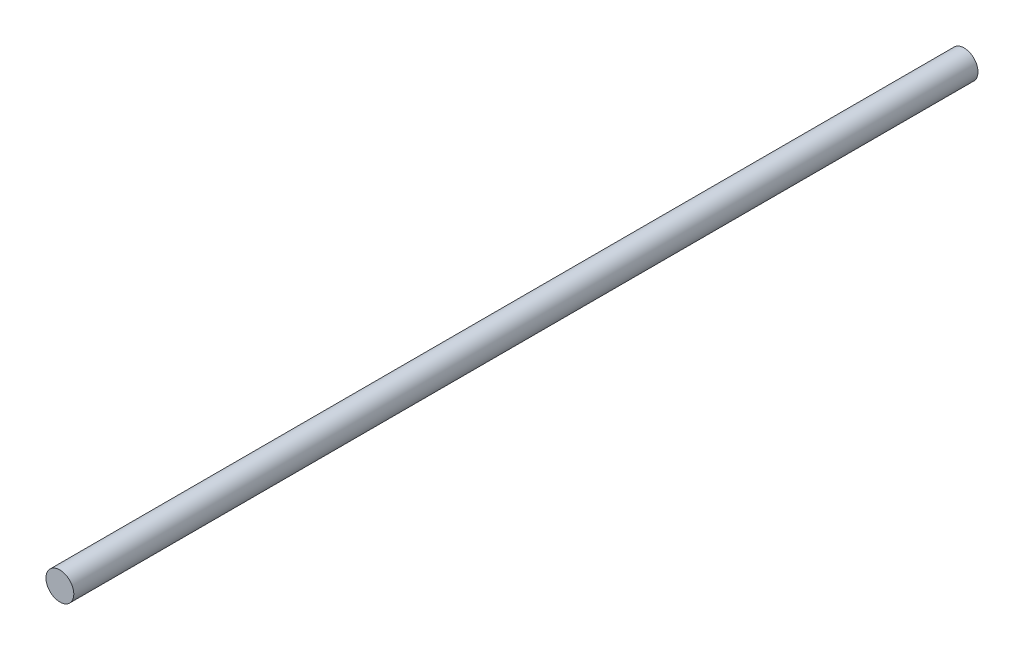
ISO-10303-21;
HEADER;
FILE_DESCRIPTION(('STEP AP214'),'2;1');
FILE_NAME('part.step','',(''),(''),'','','');
FILE_SCHEMA(('AUTOMOTIVE_DESIGN { 1 0 10303 214 1 1 1 1 }'));
ENDSEC;
DATA;
#1=APPLICATION_CONTEXT('core data for automotive mechanical design processes');
#2=APPLICATION_PROTOCOL_DEFINITION('international standard','automotive_design',2000,#1);
#3=PRODUCT_CONTEXT('',#1,'mechanical');
#4=PRODUCT('Part','Part','',(#3));
#5=PRODUCT_RELATED_PRODUCT_CATEGORY('part','',(#4));
#6=PRODUCT_DEFINITION_FORMATION('','',#4);
#7=PRODUCT_DEFINITION_CONTEXT('part definition',#1,'design');
#8=PRODUCT_DEFINITION('design','',#6,#7);
#9=PRODUCT_DEFINITION_SHAPE('','',#8);
#10=(LENGTH_UNIT() NAMED_UNIT(*) SI_UNIT(.MILLI.,.METRE.));
#11=(NAMED_UNIT(*) PLANE_ANGLE_UNIT() SI_UNIT($,.RADIAN.));
#12=(NAMED_UNIT(*) SI_UNIT($,.STERADIAN.) SOLID_ANGLE_UNIT());
#13=UNCERTAINTY_MEASURE_WITH_UNIT(LENGTH_MEASURE(1.E-05),#10,'distance_accuracy_value','');
#14=(GEOMETRIC_REPRESENTATION_CONTEXT(3) GLOBAL_UNCERTAINTY_ASSIGNED_CONTEXT((#13)) GLOBAL_UNIT_ASSIGNED_CONTEXT((#10,
#11,#12)) REPRESENTATION_CONTEXT('',''));
#15=CARTESIAN_POINT('',(0.,0.,0.));
#16=DIRECTION('',(0.,0.,1.));
#17=DIRECTION('',(1.,0.,0.));
#18=AXIS2_PLACEMENT_3D('',#15,#16,#17);
#19=CARTESIAN_POINT('',(0.,0.,130.));
#20=DIRECTION('',(0.,0.,-1.));
#21=DIRECTION('',(-1.,0.,0.));
#22=AXIS2_PLACEMENT_3D('',#19,#20,#21);
#23=CYLINDRICAL_SURFACE('',#22,2.);
#24=CARTESIAN_POINT('',(0.,0.,130.));
#25=DIRECTION('',(0.,0.,1.));
#26=DIRECTION('',(1.,0.,0.));
#27=AXIS2_PLACEMENT_3D('',#24,#25,#26);
#28=CIRCLE('',#27,2.);
#29=CARTESIAN_POINT('',(2.,0.,130.));
#30=VERTEX_POINT('',#29);
#31=EDGE_CURVE('E10',#30,#30,#28,.T.);
#32=ORIENTED_EDGE('',*,*,#31,.F.);
#33=EDGE_LOOP('',(#32));
#34=FACE_BOUND('',#33,.T.);
#35=CARTESIAN_POINT('',(0.,0.,0.));
#36=DIRECTION('',(0.,0.,1.));
#37=DIRECTION('',(1.,0.,0.));
#38=AXIS2_PLACEMENT_3D('',#35,#36,#37);
#39=CIRCLE('',#38,2.);
#40=CARTESIAN_POINT('',(2.,0.,0.));
#41=VERTEX_POINT('',#40);
#42=EDGE_CURVE('E35',#41,#41,#39,.T.);
#43=ORIENTED_EDGE('',*,*,#42,.T.);
#44=EDGE_LOOP('',(#43));
#45=FACE_BOUND('',#44,.T.);
#46=ADVANCED_FACE('F32',(#34,#45),#23,.T.);
#47=CARTESIAN_POINT('',(0.,0.,130.));
#48=DIRECTION('',(0.,0.,1.));
#49=DIRECTION('',(1.,0.,0.));
#50=AXIS2_PLACEMENT_3D('',#47,#48,#49);
#51=PLANE('',#50);
#52=ORIENTED_EDGE('',*,*,#31,.T.);
#53=EDGE_LOOP('',(#52));
#54=FACE_BOUND('',#53,.T.);
#55=ADVANCED_FACE('F47',(#54),#51,.T.);
#56=CARTESIAN_POINT('',(0.,0.,0.));
#57=DIRECTION('',(0.,0.,1.));
#58=DIRECTION('',(1.,0.,0.));
#59=AXIS2_PLACEMENT_3D('',#56,#57,#58);
#60=PLANE('',#59);
#61=ORIENTED_EDGE('',*,*,#42,.F.);
#62=EDGE_LOOP('',(#61));
#63=FACE_BOUND('',#62,.T.);
#64=ADVANCED_FACE('F45',(#63),#60,.F.);
#65=CLOSED_SHELL('',(#46,#55,#64));
#66=MANIFOLD_SOLID_BREP('B2',#65);
#67=ADVANCED_BREP_SHAPE_REPRESENTATION('',(#18,#66),#14);
#68=SHAPE_DEFINITION_REPRESENTATION(#9,#67);
ENDSEC;
END-ISO-10303-21;
